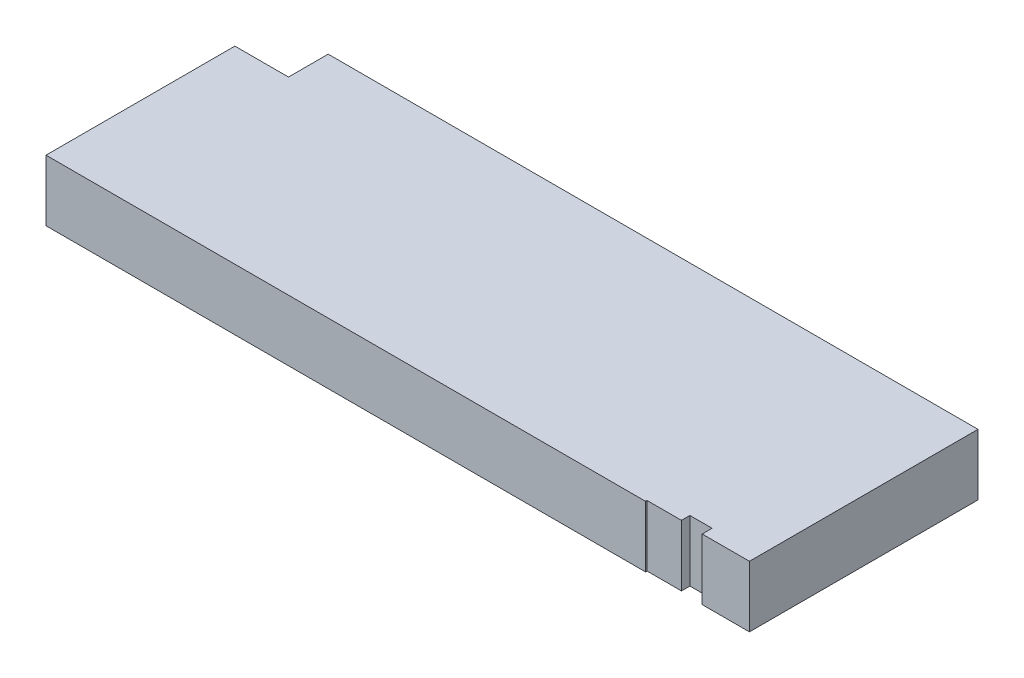
ISO-10303-21;
HEADER;
FILE_DESCRIPTION(('STEP AP214'),'2;1');
FILE_NAME('part.step','',(''),(''),'','','');
FILE_SCHEMA(('AUTOMOTIVE_DESIGN { 1 0 10303 214 1 1 1 1 }'));
ENDSEC;
DATA;
#1=APPLICATION_CONTEXT('core data for automotive mechanical design processes');
#2=APPLICATION_PROTOCOL_DEFINITION('international standard','automotive_design',2000,#1);
#3=PRODUCT_CONTEXT('',#1,'mechanical');
#4=PRODUCT('Part','Part','',(#3));
#5=PRODUCT_RELATED_PRODUCT_CATEGORY('part','',(#4));
#6=PRODUCT_DEFINITION_FORMATION('','',#4);
#7=PRODUCT_DEFINITION_CONTEXT('part definition',#1,'design');
#8=PRODUCT_DEFINITION('design','',#6,#7);
#9=PRODUCT_DEFINITION_SHAPE('','',#8);
#10=(LENGTH_UNIT() NAMED_UNIT(*) SI_UNIT(.MILLI.,.METRE.));
#11=(NAMED_UNIT(*) PLANE_ANGLE_UNIT() SI_UNIT($,.RADIAN.));
#12=(NAMED_UNIT(*) SI_UNIT($,.STERADIAN.) SOLID_ANGLE_UNIT());
#13=UNCERTAINTY_MEASURE_WITH_UNIT(LENGTH_MEASURE(1.E-05),#10,'distance_accuracy_value','');
#14=(GEOMETRIC_REPRESENTATION_CONTEXT(3) GLOBAL_UNCERTAINTY_ASSIGNED_CONTEXT((#13)) GLOBAL_UNIT_ASSIGNED_CONTEXT((#10,
#11,#12)) REPRESENTATION_CONTEXT('',''));
#15=CARTESIAN_POINT('',(0.,0.,0.));
#16=DIRECTION('',(0.,0.,1.));
#17=DIRECTION('',(1.,0.,0.));
#18=AXIS2_PLACEMENT_3D('',#15,#16,#17);
#19=CARTESIAN_POINT('',(142.05,14.49,0.));
#20=DIRECTION('',(0.,0.,-1.));
#21=DIRECTION('',(-1.,0.,0.));
#22=AXIS2_PLACEMENT_3D('',#19,#20,#21);
#23=PLANE('',#22);
#24=DIRECTION('',(1.,0.,0.));
#25=VECTOR('',#24,1.);
#26=CARTESIAN_POINT('',(142.05,0.,0.));
#27=LINE('',#26,#25);
#28=CARTESIAN_POINT('',(0.,0.,0.));
#29=VERTEX_POINT('',#28);
#30=CARTESIAN_POINT('',(142.05,0.,0.));
#31=VERTEX_POINT('',#30);
#32=EDGE_CURVE('E156',#29,#31,#27,.T.);
#33=ORIENTED_EDGE('',*,*,#32,.T.);
#34=DIRECTION('',(0.,-1.,0.));
#35=VECTOR('',#34,1.);
#36=CARTESIAN_POINT('',(142.05,14.49,0.));
#37=LINE('',#36,#35);
#38=CARTESIAN_POINT('',(142.05,14.49,0.));
#39=VERTEX_POINT('',#38);
#40=EDGE_CURVE('E11',#39,#31,#37,.T.);
#41=ORIENTED_EDGE('',*,*,#40,.F.);
#42=DIRECTION('',(1.,0.,0.));
#43=VECTOR('',#42,1.);
#44=CARTESIAN_POINT('',(142.05,14.49,0.));
#45=LINE('',#44,#43);
#46=CARTESIAN_POINT('',(0.,14.49,0.));
#47=VERTEX_POINT('',#46);
#48=EDGE_CURVE('E178',#47,#39,#45,.T.);
#49=ORIENTED_EDGE('',*,*,#48,.F.);
#50=DIRECTION('',(0.,-1.,0.));
#51=VECTOR('',#50,1.);
#52=CARTESIAN_POINT('',(0.,14.49,0.));
#53=LINE('',#52,#51);
#54=EDGE_CURVE('E152',#47,#29,#53,.T.);
#55=ORIENTED_EDGE('',*,*,#54,.T.);
#56=EDGE_LOOP('',(#33,#41,#49,#55));
#57=FACE_BOUND('',#56,.T.);
#58=ADVANCED_FACE('F36',(#57),#23,.F.);
#59=CARTESIAN_POINT('',(142.05,14.49,-0.350000000000015));
#60=DIRECTION('',(-1.,0.,0.));
#61=DIRECTION('',(0.,0.,1.));
#62=AXIS2_PLACEMENT_3D('',#59,#60,#61);
#63=PLANE('',#62);
#64=DIRECTION('',(0.,0.,-1.));
#65=VECTOR('',#64,1.);
#66=CARTESIAN_POINT('',(142.05,0.,-0.350000000000015));
#67=LINE('',#66,#65);
#68=CARTESIAN_POINT('',(142.05,0.,-0.350000000000015));
#69=VERTEX_POINT('',#68);
#70=EDGE_CURVE('E159',#31,#69,#67,.T.);
#71=ORIENTED_EDGE('',*,*,#70,.T.);
#72=DIRECTION('',(0.,-1.,0.));
#73=VECTOR('',#72,1.);
#74=CARTESIAN_POINT('',(142.05,14.49,-0.350000000000015));
#75=LINE('',#74,#73);
#76=CARTESIAN_POINT('',(142.05,14.49,-0.350000000000015));
#77=VERTEX_POINT('',#76);
#78=EDGE_CURVE('E44',#77,#69,#75,.T.);
#79=ORIENTED_EDGE('',*,*,#78,.F.);
#80=DIRECTION('',(0.,0.,-1.));
#81=VECTOR('',#80,1.);
#82=CARTESIAN_POINT('',(142.05,14.49,-0.350000000000015));
#83=LINE('',#82,#81);
#84=EDGE_CURVE('E107',#39,#77,#83,.T.);
#85=ORIENTED_EDGE('',*,*,#84,.F.);
#86=ORIENTED_EDGE('',*,*,#40,.T.);
#87=EDGE_LOOP('',(#71,#79,#85,#86));
#88=FACE_BOUND('',#87,.T.);
#89=ADVANCED_FACE('F256',(#88),#63,.F.);
#90=CARTESIAN_POINT('',(150.2,14.49,-0.350000000000016));
#91=DIRECTION('',(0.,0.,-1.));
#92=DIRECTION('',(-1.,0.,0.));
#93=AXIS2_PLACEMENT_3D('',#90,#91,#92);
#94=PLANE('',#93);
#95=DIRECTION('',(1.,0.,0.));
#96=VECTOR('',#95,1.);
#97=CARTESIAN_POINT('',(150.2,0.,-0.350000000000016));
#98=LINE('',#97,#96);
#99=CARTESIAN_POINT('',(150.2,0.,-0.350000000000016));
#100=VERTEX_POINT('',#99);
#101=EDGE_CURVE('E161',#69,#100,#98,.T.);
#102=ORIENTED_EDGE('',*,*,#101,.T.);
#103=DIRECTION('',(0.,-1.,0.));
#104=VECTOR('',#103,1.);
#105=CARTESIAN_POINT('',(150.2,14.49,-0.350000000000016));
#106=LINE('',#105,#104);
#107=CARTESIAN_POINT('',(150.2,14.49,-0.350000000000016));
#108=VERTEX_POINT('',#107);
#109=EDGE_CURVE('E197',#108,#100,#106,.T.);
#110=ORIENTED_EDGE('',*,*,#109,.F.);
#111=DIRECTION('',(1.,0.,0.));
#112=VECTOR('',#111,1.);
#113=CARTESIAN_POINT('',(150.2,14.49,-0.350000000000016));
#114=LINE('',#113,#112);
#115=EDGE_CURVE('E205',#77,#108,#114,.T.);
#116=ORIENTED_EDGE('',*,*,#115,.F.);
#117=ORIENTED_EDGE('',*,*,#78,.T.);
#118=EDGE_LOOP('',(#102,#110,#116,#117));
#119=FACE_BOUND('',#118,.T.);
#120=ADVANCED_FACE('F203',(#119),#94,.F.);
#121=CARTESIAN_POINT('',(150.2,14.49,-2.35));
#122=DIRECTION('',(-1.,0.,0.));
#123=DIRECTION('',(0.,0.,1.));
#124=AXIS2_PLACEMENT_3D('',#121,#122,#123);
#125=PLANE('',#124);
#126=DIRECTION('',(0.,0.,-1.));
#127=VECTOR('',#126,1.);
#128=CARTESIAN_POINT('',(150.2,0.,-2.35));
#129=LINE('',#128,#127);
#130=CARTESIAN_POINT('',(150.2,0.,-2.35));
#131=VERTEX_POINT('',#130);
#132=EDGE_CURVE('E163',#100,#131,#129,.T.);
#133=ORIENTED_EDGE('',*,*,#132,.T.);
#134=DIRECTION('',(0.,-1.,0.));
#135=VECTOR('',#134,1.);
#136=CARTESIAN_POINT('',(150.2,14.49,-2.35));
#137=LINE('',#136,#135);
#138=CARTESIAN_POINT('',(150.2,14.49,-2.35));
#139=VERTEX_POINT('',#138);
#140=EDGE_CURVE('E194',#139,#131,#137,.T.);
#141=ORIENTED_EDGE('',*,*,#140,.F.);
#142=DIRECTION('',(0.,0.,-1.));
#143=VECTOR('',#142,1.);
#144=CARTESIAN_POINT('',(150.2,14.49,-2.35));
#145=LINE('',#144,#143);
#146=EDGE_CURVE('E223',#108,#139,#145,.T.);
#147=ORIENTED_EDGE('',*,*,#146,.F.);
#148=ORIENTED_EDGE('',*,*,#109,.T.);
#149=EDGE_LOOP('',(#133,#141,#147,#148));
#150=FACE_BOUND('',#149,.T.);
#151=ADVANCED_FACE('F214',(#150),#125,.F.);
#152=CARTESIAN_POINT('',(155.45,14.49,-2.35));
#153=DIRECTION('',(0.,0.,-1.));
#154=DIRECTION('',(-1.,0.,0.));
#155=AXIS2_PLACEMENT_3D('',#152,#153,#154);
#156=PLANE('',#155);
#157=DIRECTION('',(1.,0.,0.));
#158=VECTOR('',#157,1.);
#159=CARTESIAN_POINT('',(155.45,0.,-2.35));
#160=LINE('',#159,#158);
#161=CARTESIAN_POINT('',(155.45,0.,-2.35));
#162=VERTEX_POINT('',#161);
#163=EDGE_CURVE('E165',#131,#162,#160,.T.);
#164=ORIENTED_EDGE('',*,*,#163,.T.);
#165=DIRECTION('',(0.,-1.,0.));
#166=VECTOR('',#165,1.);
#167=CARTESIAN_POINT('',(155.45,14.49,-2.35));
#168=LINE('',#167,#166);
#169=CARTESIAN_POINT('',(155.45,14.49,-2.35));
#170=VERTEX_POINT('',#169);
#171=EDGE_CURVE('E191',#170,#162,#168,.T.);
#172=ORIENTED_EDGE('',*,*,#171,.F.);
#173=DIRECTION('',(1.,0.,0.));
#174=VECTOR('',#173,1.);
#175=CARTESIAN_POINT('',(155.45,14.49,-2.35));
#176=LINE('',#175,#174);
#177=EDGE_CURVE('E220',#139,#170,#176,.T.);
#178=ORIENTED_EDGE('',*,*,#177,.F.);
#179=ORIENTED_EDGE('',*,*,#140,.T.);
#180=EDGE_LOOP('',(#164,#172,#178,#179));
#181=FACE_BOUND('',#180,.T.);
#182=ADVANCED_FACE('F218',(#181),#156,.F.);
#183=CARTESIAN_POINT('',(155.45,14.49,0.));
#184=DIRECTION('',(1.,0.,0.));
#185=DIRECTION('',(0.,0.,-1.));
#186=AXIS2_PLACEMENT_3D('',#183,#184,#185);
#187=PLANE('',#186);
#188=DIRECTION('',(0.,0.,1.));
#189=VECTOR('',#188,1.);
#190=CARTESIAN_POINT('',(155.45,0.,0.));
#191=LINE('',#190,#189);
#192=CARTESIAN_POINT('',(155.45,0.,0.));
#193=VERTEX_POINT('',#192);
#194=EDGE_CURVE('E167',#162,#193,#191,.T.);
#195=ORIENTED_EDGE('',*,*,#194,.T.);
#196=DIRECTION('',(0.,-1.,0.));
#197=VECTOR('',#196,1.);
#198=CARTESIAN_POINT('',(155.45,14.49,0.));
#199=LINE('',#198,#197);
#200=CARTESIAN_POINT('',(155.45,14.49,0.));
#201=VERTEX_POINT('',#200);
#202=EDGE_CURVE('E188',#201,#193,#199,.T.);
#203=ORIENTED_EDGE('',*,*,#202,.F.);
#204=DIRECTION('',(0.,0.,1.));
#205=VECTOR('',#204,1.);
#206=CARTESIAN_POINT('',(155.45,14.49,0.));
#207=LINE('',#206,#205);
#208=EDGE_CURVE('E222',#170,#201,#207,.T.);
#209=ORIENTED_EDGE('',*,*,#208,.F.);
#210=ORIENTED_EDGE('',*,*,#171,.T.);
#211=EDGE_LOOP('',(#195,#203,#209,#210));
#212=FACE_BOUND('',#211,.T.);
#213=ADVANCED_FACE('F269',(#212),#187,.F.);
#214=CARTESIAN_POINT('',(166.65,14.49,0.));
#215=DIRECTION('',(0.,0.,-1.));
#216=DIRECTION('',(-1.,0.,0.));
#217=AXIS2_PLACEMENT_3D('',#214,#215,#216);
#218=PLANE('',#217);
#219=DIRECTION('',(1.,0.,0.));
#220=VECTOR('',#219,1.);
#221=CARTESIAN_POINT('',(166.65,0.,0.));
#222=LINE('',#221,#220);
#223=CARTESIAN_POINT('',(166.65,0.,0.));
#224=VERTEX_POINT('',#223);
#225=EDGE_CURVE('E169',#193,#224,#222,.T.);
#226=ORIENTED_EDGE('',*,*,#225,.T.);
#227=DIRECTION('',(0.,-1.,0.));
#228=VECTOR('',#227,1.);
#229=CARTESIAN_POINT('',(166.65,14.49,0.));
#230=LINE('',#229,#228);
#231=CARTESIAN_POINT('',(166.65,14.49,0.));
#232=VERTEX_POINT('',#231);
#233=EDGE_CURVE('E185',#232,#224,#230,.T.);
#234=ORIENTED_EDGE('',*,*,#233,.F.);
#235=DIRECTION('',(1.,0.,0.));
#236=VECTOR('',#235,1.);
#237=CARTESIAN_POINT('',(166.65,14.49,0.));
#238=LINE('',#237,#236);
#239=EDGE_CURVE('E225',#201,#232,#238,.T.);
#240=ORIENTED_EDGE('',*,*,#239,.F.);
#241=ORIENTED_EDGE('',*,*,#202,.T.);
#242=EDGE_LOOP('',(#226,#234,#240,#241));
#243=FACE_BOUND('',#242,.T.);
#244=ADVANCED_FACE('F272',(#243),#218,.F.);
#245=CARTESIAN_POINT('',(166.65,14.49,-54.15));
#246=DIRECTION('',(-1.,0.,0.));
#247=DIRECTION('',(0.,0.,1.));
#248=AXIS2_PLACEMENT_3D('',#245,#246,#247);
#249=PLANE('',#248);
#250=DIRECTION('',(0.,0.,-1.));
#251=VECTOR('',#250,1.);
#252=CARTESIAN_POINT('',(166.65,0.,-54.15));
#253=LINE('',#252,#251);
#254=CARTESIAN_POINT('',(166.65,0.,-54.15));
#255=VERTEX_POINT('',#254);
#256=EDGE_CURVE('E171',#224,#255,#253,.T.);
#257=ORIENTED_EDGE('',*,*,#256,.T.);
#258=DIRECTION('',(0.,-1.,0.));
#259=VECTOR('',#258,1.);
#260=CARTESIAN_POINT('',(166.65,14.49,-54.15));
#261=LINE('',#260,#259);
#262=CARTESIAN_POINT('',(166.65,14.49,-54.15));
#263=VERTEX_POINT('',#262);
#264=EDGE_CURVE('E182',#263,#255,#261,.T.);
#265=ORIENTED_EDGE('',*,*,#264,.F.);
#266=DIRECTION('',(0.,0.,-1.));
#267=VECTOR('',#266,1.);
#268=CARTESIAN_POINT('',(166.65,14.49,-54.15));
#269=LINE('',#268,#267);
#270=EDGE_CURVE('E231',#232,#263,#269,.T.);
#271=ORIENTED_EDGE('',*,*,#270,.F.);
#272=ORIENTED_EDGE('',*,*,#233,.T.);
#273=EDGE_LOOP('',(#257,#265,#271,#272));
#274=FACE_BOUND('',#273,.T.);
#275=ADVANCED_FACE('F237',(#274),#249,.F.);
#276=CARTESIAN_POINT('',(12.7,14.49,-54.15));
#277=DIRECTION('',(0.,0.,1.));
#278=DIRECTION('',(1.,0.,0.));
#279=AXIS2_PLACEMENT_3D('',#276,#277,#278);
#280=PLANE('',#279);
#281=DIRECTION('',(-1.,0.,0.));
#282=VECTOR('',#281,1.);
#283=CARTESIAN_POINT('',(12.7,0.,-54.15));
#284=LINE('',#283,#282);
#285=CARTESIAN_POINT('',(12.7,0.,-54.15));
#286=VERTEX_POINT('',#285);
#287=EDGE_CURVE('E173',#255,#286,#284,.T.);
#288=ORIENTED_EDGE('',*,*,#287,.T.);
#289=DIRECTION('',(0.,-1.,0.));
#290=VECTOR('',#289,1.);
#291=CARTESIAN_POINT('',(12.7,14.49,-54.15));
#292=LINE('',#291,#290);
#293=CARTESIAN_POINT('',(12.7,14.49,-54.15));
#294=VERTEX_POINT('',#293);
#295=EDGE_CURVE('E147',#294,#286,#292,.T.);
#296=ORIENTED_EDGE('',*,*,#295,.F.);
#297=DIRECTION('',(-1.,0.,0.));
#298=VECTOR('',#297,1.);
#299=CARTESIAN_POINT('',(12.7,14.49,-54.15));
#300=LINE('',#299,#298);
#301=EDGE_CURVE('E138',#263,#294,#300,.T.);
#302=ORIENTED_EDGE('',*,*,#301,.F.);
#303=ORIENTED_EDGE('',*,*,#264,.T.);
#304=EDGE_LOOP('',(#288,#296,#302,#303));
#305=FACE_BOUND('',#304,.T.);
#306=ADVANCED_FACE('F241',(#305),#280,.F.);
#307=CARTESIAN_POINT('',(12.7,14.49,-44.75));
#308=DIRECTION('',(1.,0.,0.));
#309=DIRECTION('',(0.,0.,-1.));
#310=AXIS2_PLACEMENT_3D('',#307,#308,#309);
#311=PLANE('',#310);
#312=DIRECTION('',(0.,0.,1.));
#313=VECTOR('',#312,1.);
#314=CARTESIAN_POINT('',(12.7,0.,-44.75));
#315=LINE('',#314,#313);
#316=CARTESIAN_POINT('',(12.7,0.,-44.75));
#317=VERTEX_POINT('',#316);
#318=EDGE_CURVE('E146',#286,#317,#315,.T.);
#319=ORIENTED_EDGE('',*,*,#318,.T.);
#320=DIRECTION('',(0.,-1.,0.));
#321=VECTOR('',#320,1.);
#322=CARTESIAN_POINT('',(12.7,14.49,-44.75));
#323=LINE('',#322,#321);
#324=CARTESIAN_POINT('',(12.7,14.49,-44.75));
#325=VERTEX_POINT('',#324);
#326=EDGE_CURVE('E143',#325,#317,#323,.T.);
#327=ORIENTED_EDGE('',*,*,#326,.F.);
#328=DIRECTION('',(0.,0.,1.));
#329=VECTOR('',#328,1.);
#330=CARTESIAN_POINT('',(12.7,14.49,-44.75));
#331=LINE('',#330,#329);
#332=EDGE_CURVE('E132',#294,#325,#331,.T.);
#333=ORIENTED_EDGE('',*,*,#332,.F.);
#334=ORIENTED_EDGE('',*,*,#295,.T.);
#335=EDGE_LOOP('',(#319,#327,#333,#334));
#336=FACE_BOUND('',#335,.T.);
#337=ADVANCED_FACE('F144',(#336),#311,.F.);
#338=CARTESIAN_POINT('',(0.,14.49,-44.75));
#339=DIRECTION('',(0.,0.,1.));
#340=DIRECTION('',(1.,0.,0.));
#341=AXIS2_PLACEMENT_3D('',#338,#339,#340);
#342=PLANE('',#341);
#343=DIRECTION('',(-1.,0.,0.));
#344=VECTOR('',#343,1.);
#345=CARTESIAN_POINT('',(0.,0.,-44.75));
#346=LINE('',#345,#344);
#347=CARTESIAN_POINT('',(0.,0.,-44.75));
#348=VERTEX_POINT('',#347);
#349=EDGE_CURVE('E93',#317,#348,#346,.T.);
#350=ORIENTED_EDGE('',*,*,#349,.T.);
#351=DIRECTION('',(0.,-1.,0.));
#352=VECTOR('',#351,1.);
#353=CARTESIAN_POINT('',(0.,14.49,-44.75));
#354=LINE('',#353,#352);
#355=CARTESIAN_POINT('',(0.,14.49,-44.75));
#356=VERTEX_POINT('',#355);
#357=EDGE_CURVE('E148',#356,#348,#354,.T.);
#358=ORIENTED_EDGE('',*,*,#357,.F.);
#359=DIRECTION('',(-1.,0.,0.));
#360=VECTOR('',#359,1.);
#361=CARTESIAN_POINT('',(0.,14.49,-44.75));
#362=LINE('',#361,#360);
#363=EDGE_CURVE('E136',#325,#356,#362,.T.);
#364=ORIENTED_EDGE('',*,*,#363,.F.);
#365=ORIENTED_EDGE('',*,*,#326,.T.);
#366=EDGE_LOOP('',(#350,#358,#364,#365));
#367=FACE_BOUND('',#366,.T.);
#368=ADVANCED_FACE('F150',(#367),#342,.F.);
#369=CARTESIAN_POINT('',(0.,14.49,0.));
#370=DIRECTION('',(1.,0.,0.));
#371=DIRECTION('',(0.,0.,-1.));
#372=AXIS2_PLACEMENT_3D('',#369,#370,#371);
#373=PLANE('',#372);
#374=DIRECTION('',(0.,0.,1.));
#375=VECTOR('',#374,1.);
#376=CARTESIAN_POINT('',(0.,0.,0.));
#377=LINE('',#376,#375);
#378=EDGE_CURVE('E99',#348,#29,#377,.T.);
#379=ORIENTED_EDGE('',*,*,#378,.T.);
#380=ORIENTED_EDGE('',*,*,#54,.F.);
#381=DIRECTION('',(0.,0.,1.));
#382=VECTOR('',#381,1.);
#383=CARTESIAN_POINT('',(0.,14.49,0.));
#384=LINE('',#383,#382);
#385=EDGE_CURVE('E52',#356,#47,#384,.T.);
#386=ORIENTED_EDGE('',*,*,#385,.F.);
#387=ORIENTED_EDGE('',*,*,#357,.T.);
#388=EDGE_LOOP('',(#379,#380,#386,#387));
#389=FACE_BOUND('',#388,.T.);
#390=ADVANCED_FACE('F245',(#389),#373,.F.);
#391=CARTESIAN_POINT('',(0.,14.49,0.));
#392=DIRECTION('',(0.,-1.,0.));
#393=DIRECTION('',(0.,0.,-1.));
#394=AXIS2_PLACEMENT_3D('',#391,#392,#393);
#395=PLANE('',#394);
#396=ORIENTED_EDGE('',*,*,#48,.T.);
#397=ORIENTED_EDGE('',*,*,#84,.T.);
#398=ORIENTED_EDGE('',*,*,#115,.T.);
#399=ORIENTED_EDGE('',*,*,#146,.T.);
#400=ORIENTED_EDGE('',*,*,#177,.T.);
#401=ORIENTED_EDGE('',*,*,#208,.T.);
#402=ORIENTED_EDGE('',*,*,#239,.T.);
#403=ORIENTED_EDGE('',*,*,#270,.T.);
#404=ORIENTED_EDGE('',*,*,#301,.T.);
#405=ORIENTED_EDGE('',*,*,#332,.T.);
#406=ORIENTED_EDGE('',*,*,#363,.T.);
#407=ORIENTED_EDGE('',*,*,#385,.T.);
#408=EDGE_LOOP('',(#396,#397,#398,#399,#400,#401,#402,#403,#404,#405,#406,#407));
#409=FACE_BOUND('',#408,.T.);
#410=ADVANCED_FACE('F134',(#409),#395,.F.);
#411=CARTESIAN_POINT('',(0.,0.,0.));
#412=DIRECTION('',(0.,-1.,0.));
#413=DIRECTION('',(0.,0.,-1.));
#414=AXIS2_PLACEMENT_3D('',#411,#412,#413);
#415=PLANE('',#414);
#416=ORIENTED_EDGE('',*,*,#32,.F.);
#417=ORIENTED_EDGE('',*,*,#378,.F.);
#418=ORIENTED_EDGE('',*,*,#349,.F.);
#419=ORIENTED_EDGE('',*,*,#318,.F.);
#420=ORIENTED_EDGE('',*,*,#287,.F.);
#421=ORIENTED_EDGE('',*,*,#256,.F.);
#422=ORIENTED_EDGE('',*,*,#225,.F.);
#423=ORIENTED_EDGE('',*,*,#194,.F.);
#424=ORIENTED_EDGE('',*,*,#163,.F.);
#425=ORIENTED_EDGE('',*,*,#132,.F.);
#426=ORIENTED_EDGE('',*,*,#101,.F.);
#427=ORIENTED_EDGE('',*,*,#70,.F.);
#428=EDGE_LOOP('',(#416,#417,#418,#419,#420,#421,#422,#423,#424,#425,#426,#427));
#429=FACE_BOUND('',#428,.T.);
#430=ADVANCED_FACE('F209',(#429),#415,.T.);
#431=CLOSED_SHELL('',(#58,#89,#120,#151,#182,#213,#244,#275,#306,#337,#368,#390,#410,#430));
#432=MANIFOLD_SOLID_BREP('B2',#431);
#433=ADVANCED_BREP_SHAPE_REPRESENTATION('',(#18,#432),#14);
#434=SHAPE_DEFINITION_REPRESENTATION(#9,#433);
ENDSEC;
END-ISO-10303-21;
